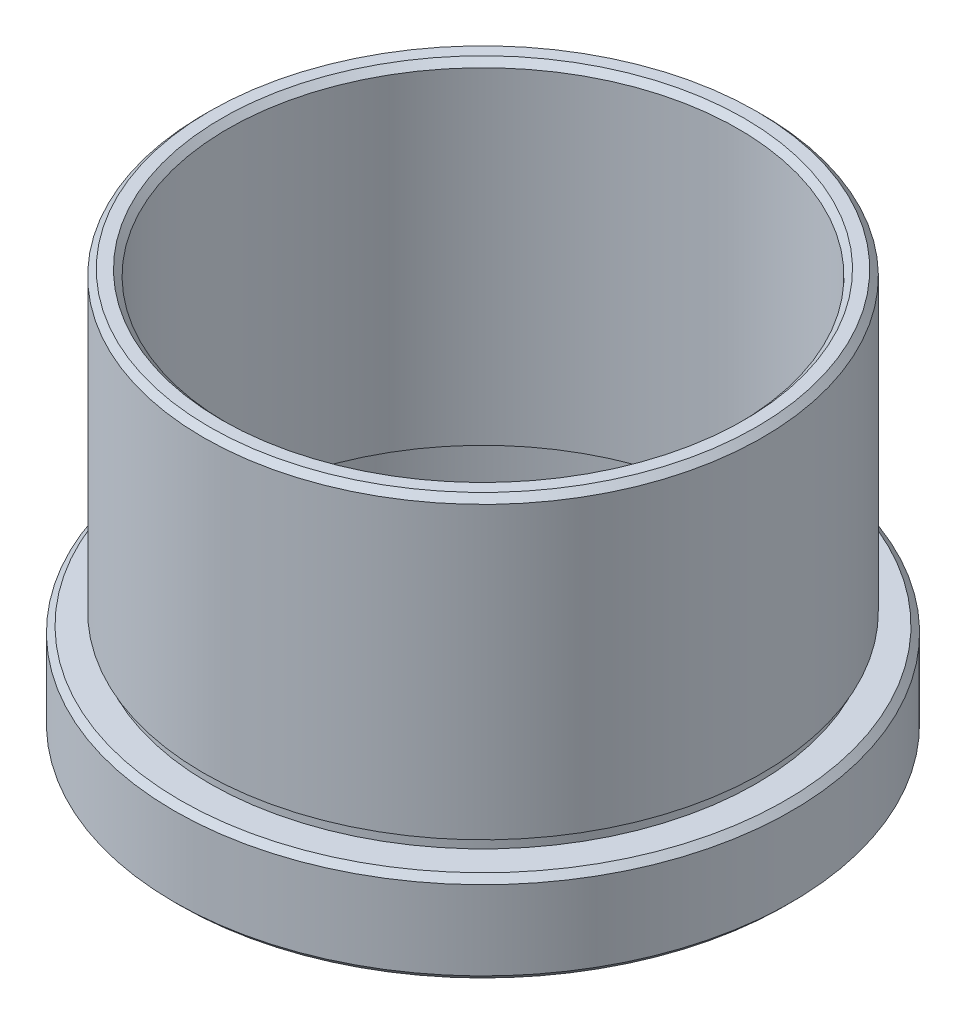
ISO-10303-21;
HEADER;
FILE_DESCRIPTION(('STEP AP214'),'2;1');
FILE_NAME('part.step','',(''),(''),'','','');
FILE_SCHEMA(('AUTOMOTIVE_DESIGN { 1 0 10303 214 1 1 1 1 }'));
ENDSEC;
DATA;
#1=APPLICATION_CONTEXT('core data for automotive mechanical design processes');
#2=APPLICATION_PROTOCOL_DEFINITION('international standard','automotive_design',2000,#1);
#3=PRODUCT_CONTEXT('',#1,'mechanical');
#4=PRODUCT('Part','Part','',(#3));
#5=PRODUCT_RELATED_PRODUCT_CATEGORY('part','',(#4));
#6=PRODUCT_DEFINITION_FORMATION('','',#4);
#7=PRODUCT_DEFINITION_CONTEXT('part definition',#1,'design');
#8=PRODUCT_DEFINITION('design','',#6,#7);
#9=PRODUCT_DEFINITION_SHAPE('','',#8);
#10=(LENGTH_UNIT() NAMED_UNIT(*) SI_UNIT(.MILLI.,.METRE.));
#11=(NAMED_UNIT(*) PLANE_ANGLE_UNIT() SI_UNIT($,.RADIAN.));
#12=(NAMED_UNIT(*) SI_UNIT($,.STERADIAN.) SOLID_ANGLE_UNIT());
#13=UNCERTAINTY_MEASURE_WITH_UNIT(LENGTH_MEASURE(1.E-05),#10,'distance_accuracy_value','');
#14=(GEOMETRIC_REPRESENTATION_CONTEXT(3) GLOBAL_UNCERTAINTY_ASSIGNED_CONTEXT((#13)) GLOBAL_UNIT_ASSIGNED_CONTEXT((#10,
#11,#12)) REPRESENTATION_CONTEXT('',''));
#15=CARTESIAN_POINT('',(0.,0.,0.));
#16=DIRECTION('',(0.,0.,1.));
#17=DIRECTION('',(1.,0.,0.));
#18=AXIS2_PLACEMENT_3D('',#15,#16,#17);
#19=CARTESIAN_POINT('',(23.,2.64285417456689,0.));
#20=DIRECTION('',(0.,1.,0.));
#21=DIRECTION('',(0.,0.,1.));
#22=AXIS2_PLACEMENT_3D('',#19,#20,#21);
#23=PLANE('',#22);
#24=CARTESIAN_POINT('',(0.,2.6428541745669,0.));
#25=DIRECTION('',(0.,1.,0.));
#26=DIRECTION('',(0.,0.,1.));
#27=AXIS2_PLACEMENT_3D('',#24,#25,#26);
#28=CIRCLE('',#27,23.);
#29=CARTESIAN_POINT('',(0.,2.6428541745669,23.));
#30=VERTEX_POINT('',#29);
#31=EDGE_CURVE('E12',#30,#30,#28,.T.);
#32=ORIENTED_EDGE('',*,*,#31,.F.);
#33=EDGE_LOOP('',(#32));
#34=FACE_BOUND('',#33,.T.);
#35=CARTESIAN_POINT('',(0.,2.6428541745669,0.));
#36=DIRECTION('',(0.,1.,0.));
#37=DIRECTION('',(0.,0.,1.));
#38=AXIS2_PLACEMENT_3D('',#35,#36,#37);
#39=CIRCLE('',#38,22.5);
#40=CARTESIAN_POINT('',(0.,2.6428541745669,22.5));
#41=VERTEX_POINT('',#40);
#42=EDGE_CURVE('E123',#41,#41,#39,.T.);
#43=ORIENTED_EDGE('',*,*,#42,.T.);
#44=EDGE_LOOP('',(#43));
#45=FACE_BOUND('',#44,.T.);
#46=ADVANCED_FACE('F51',(#34,#45),#23,.F.);
#47=CARTESIAN_POINT('',(0.,44.5985977452931,0.));
#48=DIRECTION('',(0.,1.,0.));
#49=DIRECTION('',(0.,0.,1.));
#50=AXIS2_PLACEMENT_3D('',#47,#48,#49);
#51=CYLINDRICAL_SURFACE('',#50,23.);
#52=CARTESIAN_POINT('',(0.,26.5428541745669,0.));
#53=DIRECTION('',(0.,1.,0.));
#54=DIRECTION('',(0.,0.,1.));
#55=AXIS2_PLACEMENT_3D('',#52,#53,#54);
#56=CIRCLE('',#55,23.);
#57=CARTESIAN_POINT('',(0.,26.5428541745669,23.));
#58=VERTEX_POINT('',#57);
#59=EDGE_CURVE('E58',#58,#58,#56,.T.);
#60=ORIENTED_EDGE('',*,*,#59,.F.);
#61=EDGE_LOOP('',(#60));
#62=FACE_BOUND('',#61,.T.);
#63=ORIENTED_EDGE('',*,*,#31,.T.);
#64=EDGE_LOOP('',(#63));
#65=FACE_BOUND('',#64,.T.);
#66=ADVANCED_FACE('F214',(#62,#65),#51,.T.);
#67=CARTESIAN_POINT('',(0.,26.5428541745669,0.));
#68=DIRECTION('',(0.,-1.,0.));
#69=DIRECTION('',(0.,0.,-1.));
#70=AXIS2_PLACEMENT_3D('',#67,#68,#69);
#71=CONICAL_SURFACE('',#70,23.,0.785398163397448);
#72=CARTESIAN_POINT('',(0.,27.0428541745669,0.));
#73=DIRECTION('',(0.,1.,0.));
#74=DIRECTION('',(0.,0.,1.));
#75=AXIS2_PLACEMENT_3D('',#72,#73,#74);
#76=CIRCLE('',#75,22.5);
#77=CARTESIAN_POINT('',(0.,27.0428541745669,22.5));
#78=VERTEX_POINT('',#77);
#79=EDGE_CURVE('E64',#78,#78,#76,.T.);
#80=ORIENTED_EDGE('',*,*,#79,.F.);
#81=EDGE_LOOP('',(#80));
#82=FACE_BOUND('',#81,.T.);
#83=ORIENTED_EDGE('',*,*,#59,.T.);
#84=EDGE_LOOP('',(#83));
#85=FACE_BOUND('',#84,.T.);
#86=ADVANCED_FACE('F209',(#82,#85),#71,.T.);
#87=CARTESIAN_POINT('',(21.5,27.0428541745669,0.));
#88=DIRECTION('',(0.,-1.,0.));
#89=DIRECTION('',(0.,0.,-1.));
#90=AXIS2_PLACEMENT_3D('',#87,#88,#89);
#91=PLANE('',#90);
#92=CARTESIAN_POINT('',(0.,27.0428541745669,0.));
#93=DIRECTION('',(0.,1.,0.));
#94=DIRECTION('',(0.,0.,1.));
#95=AXIS2_PLACEMENT_3D('',#92,#93,#94);
#96=CIRCLE('',#95,21.5);
#97=CARTESIAN_POINT('',(0.,27.0428541745669,21.5));
#98=VERTEX_POINT('',#97);
#99=EDGE_CURVE('E71',#98,#98,#96,.T.);
#100=ORIENTED_EDGE('',*,*,#99,.F.);
#101=EDGE_LOOP('',(#100));
#102=FACE_BOUND('',#101,.T.);
#103=ORIENTED_EDGE('',*,*,#79,.T.);
#104=EDGE_LOOP('',(#103));
#105=FACE_BOUND('',#104,.T.);
#106=ADVANCED_FACE('F203',(#102,#105),#91,.F.);
#107=CARTESIAN_POINT('',(0.,27.0428541745669,0.));
#108=DIRECTION('',(0.,1.,0.));
#109=DIRECTION('',(0.,0.,1.));
#110=AXIS2_PLACEMENT_3D('',#107,#108,#109);
#111=CONICAL_SURFACE('',#110,21.5,0.785398163397448);
#112=CARTESIAN_POINT('',(0.,26.5428541745669,0.));
#113=DIRECTION('',(0.,1.,0.));
#114=DIRECTION('',(0.,0.,1.));
#115=AXIS2_PLACEMENT_3D('',#112,#113,#114);
#116=CIRCLE('',#115,21.);
#117=CARTESIAN_POINT('',(0.,26.5428541745669,21.));
#118=VERTEX_POINT('',#117);
#119=EDGE_CURVE('E76',#118,#118,#116,.T.);
#120=ORIENTED_EDGE('',*,*,#119,.F.);
#121=EDGE_LOOP('',(#120));
#122=FACE_BOUND('',#121,.T.);
#123=ORIENTED_EDGE('',*,*,#99,.T.);
#124=EDGE_LOOP('',(#123));
#125=FACE_BOUND('',#124,.T.);
#126=ADVANCED_FACE('F197',(#122,#125),#111,.F.);
#127=CARTESIAN_POINT('',(0.,44.5985977452931,0.));
#128=DIRECTION('',(0.,1.,0.));
#129=DIRECTION('',(0.,0.,1.));
#130=AXIS2_PLACEMENT_3D('',#127,#128,#129);
#131=CYLINDRICAL_SURFACE('',#130,21.);
#132=CARTESIAN_POINT('',(0.,-0.357145825433107,0.));
#133=DIRECTION('',(0.,1.,0.));
#134=DIRECTION('',(0.,0.,1.));
#135=AXIS2_PLACEMENT_3D('',#132,#133,#134);
#136=CIRCLE('',#135,21.);
#137=CARTESIAN_POINT('',(0.,-0.357145825433107,21.));
#138=VERTEX_POINT('',#137);
#139=EDGE_CURVE('E80',#138,#138,#136,.T.);
#140=ORIENTED_EDGE('',*,*,#139,.F.);
#141=EDGE_LOOP('',(#140));
#142=FACE_BOUND('',#141,.T.);
#143=ORIENTED_EDGE('',*,*,#119,.T.);
#144=EDGE_LOOP('',(#143));
#145=FACE_BOUND('',#144,.T.);
#146=ADVANCED_FACE('F191',(#142,#145),#131,.F.);
#147=CARTESIAN_POINT('',(24.1,-0.357145825433106,0.));
#148=DIRECTION('',(0.,1.,0.));
#149=DIRECTION('',(0.,0.,1.));
#150=AXIS2_PLACEMENT_3D('',#147,#148,#149);
#151=PLANE('',#150);
#152=CARTESIAN_POINT('',(0.,-0.357145825433107,0.));
#153=DIRECTION('',(0.,1.,0.));
#154=DIRECTION('',(0.,0.,1.));
#155=AXIS2_PLACEMENT_3D('',#152,#153,#154);
#156=CIRCLE('',#155,24.1);
#157=CARTESIAN_POINT('',(0.,-0.357145825433107,24.1));
#158=VERTEX_POINT('',#157);
#159=EDGE_CURVE('E84',#158,#158,#156,.T.);
#160=ORIENTED_EDGE('',*,*,#159,.F.);
#161=EDGE_LOOP('',(#160));
#162=FACE_BOUND('',#161,.T.);
#163=ORIENTED_EDGE('',*,*,#139,.T.);
#164=EDGE_LOOP('',(#163));
#165=FACE_BOUND('',#164,.T.);
#166=ADVANCED_FACE('F185',(#162,#165),#151,.F.);
#167=CARTESIAN_POINT('',(0.,44.5985977452931,0.));
#168=DIRECTION('',(0.,1.,0.));
#169=DIRECTION('',(0.,0.,1.));
#170=AXIS2_PLACEMENT_3D('',#167,#168,#169);
#171=CYLINDRICAL_SURFACE('',#170,24.1);
#172=CARTESIAN_POINT('',(0.,-1.35714582543311,0.));
#173=DIRECTION('',(0.,1.,0.));
#174=DIRECTION('',(0.,0.,1.));
#175=AXIS2_PLACEMENT_3D('',#172,#173,#174);
#176=CIRCLE('',#175,24.1);
#177=CARTESIAN_POINT('',(0.,-1.35714582543311,24.1));
#178=VERTEX_POINT('',#177);
#179=EDGE_CURVE('E88',#178,#178,#176,.T.);
#180=ORIENTED_EDGE('',*,*,#179,.F.);
#181=EDGE_LOOP('',(#180));
#182=FACE_BOUND('',#181,.T.);
#183=ORIENTED_EDGE('',*,*,#159,.T.);
#184=EDGE_LOOP('',(#183));
#185=FACE_BOUND('',#184,.T.);
#186=ADVANCED_FACE('F179',(#182,#185),#171,.F.);
#187=CARTESIAN_POINT('',(24.,-1.35714582543311,0.));
#188=DIRECTION('',(0.,-1.,0.));
#189=DIRECTION('',(0.,0.,-1.));
#190=AXIS2_PLACEMENT_3D('',#187,#188,#189);
#191=PLANE('',#190);
#192=CARTESIAN_POINT('',(0.,-1.35714582543311,0.));
#193=DIRECTION('',(0.,1.,0.));
#194=DIRECTION('',(0.,0.,1.));
#195=AXIS2_PLACEMENT_3D('',#192,#193,#194);
#196=CIRCLE('',#195,24.);
#197=CARTESIAN_POINT('',(0.,-1.35714582543311,24.));
#198=VERTEX_POINT('',#197);
#199=EDGE_CURVE('E92',#198,#198,#196,.T.);
#200=ORIENTED_EDGE('',*,*,#199,.F.);
#201=EDGE_LOOP('',(#200));
#202=FACE_BOUND('',#201,.T.);
#203=ORIENTED_EDGE('',*,*,#179,.T.);
#204=EDGE_LOOP('',(#203));
#205=FACE_BOUND('',#204,.T.);
#206=ADVANCED_FACE('F173',(#202,#205),#191,.F.);
#207=CARTESIAN_POINT('',(0.,44.5985977452931,0.));
#208=DIRECTION('',(0.,1.,0.));
#209=DIRECTION('',(0.,0.,1.));
#210=AXIS2_PLACEMENT_3D('',#207,#208,#209);
#211=CYLINDRICAL_SURFACE('',#210,24.);
#212=CARTESIAN_POINT('',(0.,-5.3571458254331,0.));
#213=DIRECTION('',(0.,1.,0.));
#214=DIRECTION('',(0.,0.,1.));
#215=AXIS2_PLACEMENT_3D('',#212,#213,#214);
#216=CIRCLE('',#215,24.);
#217=CARTESIAN_POINT('',(0.,-5.3571458254331,24.));
#218=VERTEX_POINT('',#217);
#219=EDGE_CURVE('E96',#218,#218,#216,.T.);
#220=ORIENTED_EDGE('',*,*,#219,.F.);
#221=EDGE_LOOP('',(#220));
#222=FACE_BOUND('',#221,.T.);
#223=ORIENTED_EDGE('',*,*,#199,.T.);
#224=EDGE_LOOP('',(#223));
#225=FACE_BOUND('',#224,.T.);
#226=ADVANCED_FACE('F167',(#222,#225),#211,.F.);
#227=CARTESIAN_POINT('',(0.,-5.3571458254331,0.));
#228=DIRECTION('',(0.,-1.,0.));
#229=DIRECTION('',(0.,0.,-1.));
#230=AXIS2_PLACEMENT_3D('',#227,#228,#229);
#231=CONICAL_SURFACE('',#230,24.,0.785398163397448);
#232=CARTESIAN_POINT('',(0.,-5.85714582543311,0.));
#233=DIRECTION('',(0.,1.,0.));
#234=DIRECTION('',(0.,0.,1.));
#235=AXIS2_PLACEMENT_3D('',#232,#233,#234);
#236=CIRCLE('',#235,24.5);
#237=CARTESIAN_POINT('',(0.,-5.85714582543311,24.5));
#238=VERTEX_POINT('',#237);
#239=EDGE_CURVE('E100',#238,#238,#236,.T.);
#240=ORIENTED_EDGE('',*,*,#239,.F.);
#241=EDGE_LOOP('',(#240));
#242=FACE_BOUND('',#241,.T.);
#243=ORIENTED_EDGE('',*,*,#219,.T.);
#244=EDGE_LOOP('',(#243));
#245=FACE_BOUND('',#244,.T.);
#246=ADVANCED_FACE('F161',(#242,#245),#231,.F.);
#247=CARTESIAN_POINT('',(24.9,-5.85714582543311,0.));
#248=DIRECTION('',(0.,1.,0.));
#249=DIRECTION('',(0.,0.,1.));
#250=AXIS2_PLACEMENT_3D('',#247,#248,#249);
#251=PLANE('',#250);
#252=CARTESIAN_POINT('',(0.,-5.85714582543311,0.));
#253=DIRECTION('',(0.,1.,0.));
#254=DIRECTION('',(0.,0.,1.));
#255=AXIS2_PLACEMENT_3D('',#252,#253,#254);
#256=CIRCLE('',#255,24.9);
#257=CARTESIAN_POINT('',(0.,-5.85714582543311,24.9));
#258=VERTEX_POINT('',#257);
#259=EDGE_CURVE('E104',#258,#258,#256,.T.);
#260=ORIENTED_EDGE('',*,*,#259,.F.);
#261=EDGE_LOOP('',(#260));
#262=FACE_BOUND('',#261,.T.);
#263=ORIENTED_EDGE('',*,*,#239,.T.);
#264=EDGE_LOOP('',(#263));
#265=FACE_BOUND('',#264,.T.);
#266=ADVANCED_FACE('F155',(#262,#265),#251,.F.);
#267=CARTESIAN_POINT('',(0.,-5.85714582543311,0.));
#268=DIRECTION('',(0.,1.,0.));
#269=DIRECTION('',(0.,0.,1.));
#270=AXIS2_PLACEMENT_3D('',#267,#268,#269);
#271=CONICAL_SURFACE('',#270,24.9,0.785398163397452);
#272=CARTESIAN_POINT('',(0.,-5.3571458254331,0.));
#273=DIRECTION('',(0.,1.,0.));
#274=DIRECTION('',(0.,0.,1.));
#275=AXIS2_PLACEMENT_3D('',#272,#273,#274);
#276=CIRCLE('',#275,25.4);
#277=CARTESIAN_POINT('',(0.,-5.3571458254331,25.4));
#278=VERTEX_POINT('',#277);
#279=EDGE_CURVE('E108',#278,#278,#276,.T.);
#280=ORIENTED_EDGE('',*,*,#279,.F.);
#281=EDGE_LOOP('',(#280));
#282=FACE_BOUND('',#281,.T.);
#283=ORIENTED_EDGE('',*,*,#259,.T.);
#284=EDGE_LOOP('',(#283));
#285=FACE_BOUND('',#284,.T.);
#286=ADVANCED_FACE('F149',(#282,#285),#271,.T.);
#287=CARTESIAN_POINT('',(0.,44.5985977452931,0.));
#288=DIRECTION('',(0.,1.,0.));
#289=DIRECTION('',(0.,0.,1.));
#290=AXIS2_PLACEMENT_3D('',#287,#288,#289);
#291=CYLINDRICAL_SURFACE('',#290,25.4);
#292=CARTESIAN_POINT('',(0.,1.14285417456689,0.));
#293=DIRECTION('',(0.,1.,0.));
#294=DIRECTION('',(0.,0.,1.));
#295=AXIS2_PLACEMENT_3D('',#292,#293,#294);
#296=CIRCLE('',#295,25.4);
#297=CARTESIAN_POINT('',(0.,1.14285417456689,25.4));
#298=VERTEX_POINT('',#297);
#299=EDGE_CURVE('E112',#298,#298,#296,.T.);
#300=ORIENTED_EDGE('',*,*,#299,.F.);
#301=EDGE_LOOP('',(#300));
#302=FACE_BOUND('',#301,.T.);
#303=ORIENTED_EDGE('',*,*,#279,.T.);
#304=EDGE_LOOP('',(#303));
#305=FACE_BOUND('',#304,.T.);
#306=ADVANCED_FACE('F143',(#302,#305),#291,.T.);
#307=CARTESIAN_POINT('',(0.,1.14285417456689,0.));
#308=DIRECTION('',(0.,-1.,0.));
#309=DIRECTION('',(0.,0.,-1.));
#310=AXIS2_PLACEMENT_3D('',#307,#308,#309);
#311=CONICAL_SURFACE('',#310,25.4,0.785398163397452);
#312=CARTESIAN_POINT('',(0.,1.64285417456689,0.));
#313=DIRECTION('',(0.,1.,0.));
#314=DIRECTION('',(0.,0.,1.));
#315=AXIS2_PLACEMENT_3D('',#312,#313,#314);
#316=CIRCLE('',#315,24.9);
#317=CARTESIAN_POINT('',(0.,1.64285417456689,24.9));
#318=VERTEX_POINT('',#317);
#319=EDGE_CURVE('E116',#318,#318,#316,.T.);
#320=ORIENTED_EDGE('',*,*,#319,.F.);
#321=EDGE_LOOP('',(#320));
#322=FACE_BOUND('',#321,.T.);
#323=ORIENTED_EDGE('',*,*,#299,.T.);
#324=EDGE_LOOP('',(#323));
#325=FACE_BOUND('',#324,.T.);
#326=ADVANCED_FACE('F137',(#322,#325),#311,.T.);
#327=CARTESIAN_POINT('',(22.5,1.64285417456689,0.));
#328=DIRECTION('',(0.,-1.,0.));
#329=DIRECTION('',(0.,0.,-1.));
#330=AXIS2_PLACEMENT_3D('',#327,#328,#329);
#331=PLANE('',#330);
#332=CARTESIAN_POINT('',(0.,1.64285417456689,0.));
#333=DIRECTION('',(0.,1.,0.));
#334=DIRECTION('',(0.,0.,1.));
#335=AXIS2_PLACEMENT_3D('',#332,#333,#334);
#336=CIRCLE('',#335,22.5);
#337=CARTESIAN_POINT('',(0.,1.64285417456689,22.5));
#338=VERTEX_POINT('',#337);
#339=EDGE_CURVE('E119',#338,#338,#336,.T.);
#340=ORIENTED_EDGE('',*,*,#339,.F.);
#341=EDGE_LOOP('',(#340));
#342=FACE_BOUND('',#341,.T.);
#343=ORIENTED_EDGE('',*,*,#319,.T.);
#344=EDGE_LOOP('',(#343));
#345=FACE_BOUND('',#344,.T.);
#346=ADVANCED_FACE('F131',(#342,#345),#331,.F.);
#347=CARTESIAN_POINT('',(0.,44.5985977452931,0.));
#348=DIRECTION('',(0.,1.,0.));
#349=DIRECTION('',(0.,0.,1.));
#350=AXIS2_PLACEMENT_3D('',#347,#348,#349);
#351=CYLINDRICAL_SURFACE('',#350,22.5);
#352=ORIENTED_EDGE('',*,*,#42,.F.);
#353=EDGE_LOOP('',(#352));
#354=FACE_BOUND('',#353,.T.);
#355=ORIENTED_EDGE('',*,*,#339,.T.);
#356=EDGE_LOOP('',(#355));
#357=FACE_BOUND('',#356,.T.);
#358=ADVANCED_FACE('F128',(#354,#357),#351,.T.);
#359=CLOSED_SHELL('',(#46,#66,#86,#106,#126,#146,#166,#186,#206,#226,#246,#266,#286,#306,#326,
#346,#358));
#360=MANIFOLD_SOLID_BREP('B2',#359);
#361=ADVANCED_BREP_SHAPE_REPRESENTATION('',(#18,#360),#14);
#362=SHAPE_DEFINITION_REPRESENTATION(#9,#361);
ENDSEC;
END-ISO-10303-21;
